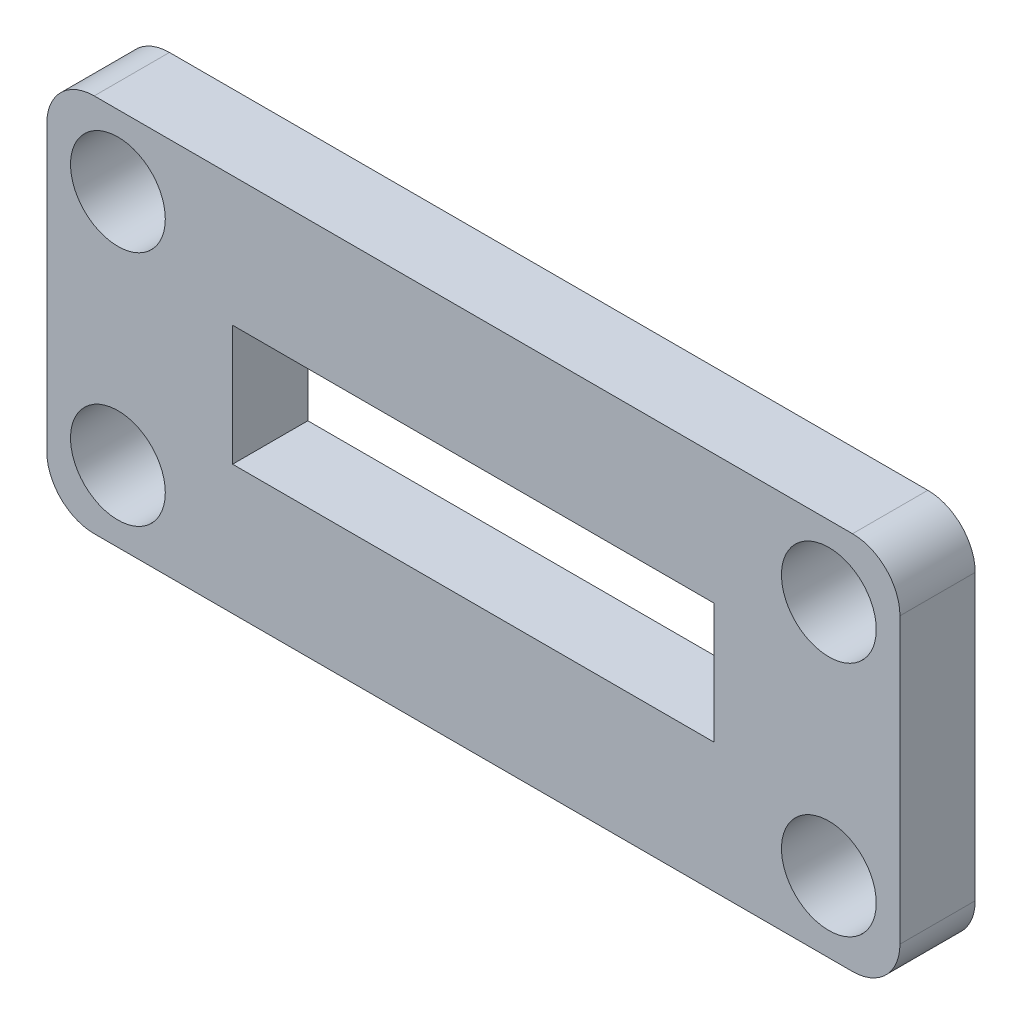
ISO-10303-21;
HEADER;
FILE_DESCRIPTION(('STEP AP214'),'2;1');
FILE_NAME('part.step','',(''),(''),'','','');
FILE_SCHEMA(('AUTOMOTIVE_DESIGN { 1 0 10303 214 1 1 1 1 }'));
ENDSEC;
DATA;
#1=APPLICATION_CONTEXT('core data for automotive mechanical design processes');
#2=APPLICATION_PROTOCOL_DEFINITION('international standard','automotive_design',2000,#1);
#3=PRODUCT_CONTEXT('',#1,'mechanical');
#4=PRODUCT('Part','Part','',(#3));
#5=PRODUCT_RELATED_PRODUCT_CATEGORY('part','',(#4));
#6=PRODUCT_DEFINITION_FORMATION('','',#4);
#7=PRODUCT_DEFINITION_CONTEXT('part definition',#1,'design');
#8=PRODUCT_DEFINITION('design','',#6,#7);
#9=PRODUCT_DEFINITION_SHAPE('','',#8);
#10=(LENGTH_UNIT() NAMED_UNIT(*) SI_UNIT(.MILLI.,.METRE.));
#11=(NAMED_UNIT(*) PLANE_ANGLE_UNIT() SI_UNIT($,.RADIAN.));
#12=(NAMED_UNIT(*) SI_UNIT($,.STERADIAN.) SOLID_ANGLE_UNIT());
#13=UNCERTAINTY_MEASURE_WITH_UNIT(LENGTH_MEASURE(1.E-05),#10,'distance_accuracy_value','');
#14=(GEOMETRIC_REPRESENTATION_CONTEXT(3) GLOBAL_UNCERTAINTY_ASSIGNED_CONTEXT((#13)) GLOBAL_UNIT_ASSIGNED_CONTEXT((#10,
#11,#12)) REPRESENTATION_CONTEXT('',''));
#15=CARTESIAN_POINT('',(0.,0.,0.));
#16=DIRECTION('',(0.,0.,1.));
#17=DIRECTION('',(1.,0.,0.));
#18=AXIS2_PLACEMENT_3D('',#15,#16,#17);
#19=CARTESIAN_POINT('',(16.,6.,3.175));
#20=DIRECTION('',(0.,0.,1.));
#21=DIRECTION('',(1.,0.,0.));
#22=AXIS2_PLACEMENT_3D('',#19,#20,#21);
#23=PLANE('',#22);
#24=CARTESIAN_POINT('',(15.,-5.,3.175));
#25=DIRECTION('',(0.,0.,1.));
#26=DIRECTION('',(1.,0.,0.));
#27=AXIS2_PLACEMENT_3D('',#24,#25,#26);
#28=CIRCLE('',#27,2.);
#29=CARTESIAN_POINT('',(17.,-5.,3.175));
#30=VERTEX_POINT('',#29);
#31=EDGE_CURVE('E320',#30,#30,#28,.T.);
#32=ORIENTED_EDGE('',*,*,#31,.F.);
#33=EDGE_LOOP('',(#32));
#34=FACE_BOUND('',#33,.T.);
#35=CARTESIAN_POINT('',(-15.,5.,3.175));
#36=DIRECTION('',(0.,0.,1.));
#37=DIRECTION('',(1.,0.,0.));
#38=AXIS2_PLACEMENT_3D('',#35,#36,#37);
#39=CIRCLE('',#38,2.);
#40=CARTESIAN_POINT('',(-13.,5.,3.175));
#41=VERTEX_POINT('',#40);
#42=EDGE_CURVE('E151',#41,#41,#39,.T.);
#43=ORIENTED_EDGE('',*,*,#42,.F.);
#44=EDGE_LOOP('',(#43));
#45=FACE_BOUND('',#44,.T.);
#46=CARTESIAN_POINT('',(16.,6.,3.175));
#47=DIRECTION('',(0.,0.,1.));
#48=DIRECTION('',(1.,0.,0.));
#49=AXIS2_PLACEMENT_3D('',#46,#47,#48);
#50=CIRCLE('',#49,2.);
#51=CARTESIAN_POINT('',(18.,6.,3.175));
#52=VERTEX_POINT('',#51);
#53=CARTESIAN_POINT('',(16.,8.,3.175));
#54=VERTEX_POINT('',#53);
#55=EDGE_CURVE('E161',#52,#54,#50,.T.);
#56=ORIENTED_EDGE('',*,*,#55,.T.);
#57=DIRECTION('',(-1.,0.,0.));
#58=VECTOR('',#57,1.);
#59=CARTESIAN_POINT('',(16.,8.,3.175));
#60=LINE('',#59,#58);
#61=CARTESIAN_POINT('',(-16.,7.99999999999999,3.175));
#62=VERTEX_POINT('',#61);
#63=EDGE_CURVE('E164',#54,#62,#60,.T.);
#64=ORIENTED_EDGE('',*,*,#63,.T.);
#65=CARTESIAN_POINT('',(-16.,6.,3.175));
#66=DIRECTION('',(0.,0.,1.));
#67=DIRECTION('',(1.,0.,0.));
#68=AXIS2_PLACEMENT_3D('',#65,#66,#67);
#69=CIRCLE('',#68,2.);
#70=CARTESIAN_POINT('',(-18.,6.,3.175));
#71=VERTEX_POINT('',#70);
#72=EDGE_CURVE('E167',#62,#71,#69,.T.);
#73=ORIENTED_EDGE('',*,*,#72,.T.);
#74=DIRECTION('',(0.,-1.,0.));
#75=VECTOR('',#74,1.);
#76=CARTESIAN_POINT('',(-18.,-6.,3.175));
#77=LINE('',#76,#75);
#78=CARTESIAN_POINT('',(-18.,-6.,3.175));
#79=VERTEX_POINT('',#78);
#80=EDGE_CURVE('E169',#71,#79,#77,.T.);
#81=ORIENTED_EDGE('',*,*,#80,.T.);
#82=CARTESIAN_POINT('',(-16.,-6.,3.175));
#83=DIRECTION('',(0.,0.,1.));
#84=DIRECTION('',(1.,0.,0.));
#85=AXIS2_PLACEMENT_3D('',#82,#83,#84);
#86=CIRCLE('',#85,2.);
#87=CARTESIAN_POINT('',(-16.,-8.,3.175));
#88=VERTEX_POINT('',#87);
#89=EDGE_CURVE('E171',#79,#88,#86,.T.);
#90=ORIENTED_EDGE('',*,*,#89,.T.);
#91=DIRECTION('',(1.,0.,0.));
#92=VECTOR('',#91,1.);
#93=CARTESIAN_POINT('',(16.,-8.,3.175));
#94=LINE('',#93,#92);
#95=CARTESIAN_POINT('',(16.,-8.,3.175));
#96=VERTEX_POINT('',#95);
#97=EDGE_CURVE('E173',#88,#96,#94,.T.);
#98=ORIENTED_EDGE('',*,*,#97,.T.);
#99=CARTESIAN_POINT('',(16.,-6.,3.175));
#100=DIRECTION('',(0.,0.,1.));
#101=DIRECTION('',(1.,0.,0.));
#102=AXIS2_PLACEMENT_3D('',#99,#100,#101);
#103=CIRCLE('',#102,2.);
#104=CARTESIAN_POINT('',(18.,-6.,3.175));
#105=VERTEX_POINT('',#104);
#106=EDGE_CURVE('E175',#96,#105,#103,.T.);
#107=ORIENTED_EDGE('',*,*,#106,.T.);
#108=DIRECTION('',(0.,1.,0.));
#109=VECTOR('',#108,1.);
#110=CARTESIAN_POINT('',(18.,-6.,3.175));
#111=LINE('',#110,#109);
#112=EDGE_CURVE('E177',#105,#52,#111,.T.);
#113=ORIENTED_EDGE('',*,*,#112,.T.);
#114=EDGE_LOOP('',(#56,#64,#73,#81,#90,#98,#107,#113));
#115=FACE_BOUND('',#114,.T.);
#116=DIRECTION('',(0.,1.,0.));
#117=VECTOR('',#116,1.);
#118=CARTESIAN_POINT('',(10.16,-2.54,3.175));
#119=LINE('',#118,#117);
#120=CARTESIAN_POINT('',(10.16,-2.54,3.175));
#121=VERTEX_POINT('',#120);
#122=CARTESIAN_POINT('',(10.16,2.53999999999999,3.175));
#123=VERTEX_POINT('',#122);
#124=EDGE_CURVE('E130',#121,#123,#119,.T.);
#125=ORIENTED_EDGE('',*,*,#124,.F.);
#126=DIRECTION('',(1.,0.,0.));
#127=VECTOR('',#126,1.);
#128=CARTESIAN_POINT('',(10.16,-2.54,3.175));
#129=LINE('',#128,#127);
#130=CARTESIAN_POINT('',(-10.16,-2.54,3.175));
#131=VERTEX_POINT('',#130);
#132=EDGE_CURVE('E122',#131,#121,#129,.T.);
#133=ORIENTED_EDGE('',*,*,#132,.F.);
#134=DIRECTION('',(0.,-1.,0.));
#135=VECTOR('',#134,1.);
#136=CARTESIAN_POINT('',(-10.16,-2.54,3.175));
#137=LINE('',#136,#135);
#138=CARTESIAN_POINT('',(-10.16,2.54,3.175));
#139=VERTEX_POINT('',#138);
#140=EDGE_CURVE('E145',#139,#131,#137,.T.);
#141=ORIENTED_EDGE('',*,*,#140,.F.);
#142=DIRECTION('',(-1.,0.,0.));
#143=VECTOR('',#142,1.);
#144=CARTESIAN_POINT('',(10.16,2.53999999999999,3.175));
#145=LINE('',#144,#143);
#146=EDGE_CURVE('E143',#123,#139,#145,.T.);
#147=ORIENTED_EDGE('',*,*,#146,.F.);
#148=EDGE_LOOP('',(#125,#133,#141,#147));
#149=FACE_BOUND('',#148,.T.);
#150=CARTESIAN_POINT('',(-15.,-5.00000000000001,3.175));
#151=DIRECTION('',(0.,0.,1.));
#152=DIRECTION('',(1.,0.,0.));
#153=AXIS2_PLACEMENT_3D('',#150,#151,#152);
#154=CIRCLE('',#153,2.);
#155=CARTESIAN_POINT('',(-13.,-5.00000000000001,3.175));
#156=VERTEX_POINT('',#155);
#157=EDGE_CURVE('E326',#156,#156,#154,.T.);
#158=ORIENTED_EDGE('',*,*,#157,.F.);
#159=EDGE_LOOP('',(#158));
#160=FACE_BOUND('',#159,.T.);
#161=CARTESIAN_POINT('',(15.,5.,3.175));
#162=DIRECTION('',(0.,0.,1.));
#163=DIRECTION('',(1.,0.,0.));
#164=AXIS2_PLACEMENT_3D('',#161,#162,#163);
#165=CIRCLE('',#164,2.);
#166=CARTESIAN_POINT('',(17.,5.,3.175));
#167=VERTEX_POINT('',#166);
#168=EDGE_CURVE('E311',#167,#167,#165,.T.);
#169=ORIENTED_EDGE('',*,*,#168,.F.);
#170=EDGE_LOOP('',(#169));
#171=FACE_BOUND('',#170,.T.);
#172=ADVANCED_FACE('F33',(#34,#45,#115,#149,#160,#171),#23,.T.);
#173=CARTESIAN_POINT('',(16.,6.,0.));
#174=DIRECTION('',(0.,0.,1.));
#175=DIRECTION('',(1.,0.,0.));
#176=AXIS2_PLACEMENT_3D('',#173,#174,#175);
#177=PLANE('',#176);
#178=CARTESIAN_POINT('',(15.,-5.,0.));
#179=DIRECTION('',(0.,0.,1.));
#180=DIRECTION('',(1.,0.,0.));
#181=AXIS2_PLACEMENT_3D('',#178,#179,#180);
#182=CIRCLE('',#181,2.);
#183=CARTESIAN_POINT('',(17.,-5.,0.));
#184=VERTEX_POINT('',#183);
#185=EDGE_CURVE('E317',#184,#184,#182,.T.);
#186=ORIENTED_EDGE('',*,*,#185,.T.);
#187=EDGE_LOOP('',(#186));
#188=FACE_BOUND('',#187,.T.);
#189=CARTESIAN_POINT('',(-15.,5.,0.));
#190=DIRECTION('',(0.,0.,1.));
#191=DIRECTION('',(1.,0.,0.));
#192=AXIS2_PLACEMENT_3D('',#189,#190,#191);
#193=CIRCLE('',#192,2.);
#194=CARTESIAN_POINT('',(-13.,5.,0.));
#195=VERTEX_POINT('',#194);
#196=EDGE_CURVE('E329',#195,#195,#193,.T.);
#197=ORIENTED_EDGE('',*,*,#196,.T.);
#198=EDGE_LOOP('',(#197));
#199=FACE_BOUND('',#198,.T.);
#200=CARTESIAN_POINT('',(16.,6.,0.));
#201=DIRECTION('',(0.,0.,1.));
#202=DIRECTION('',(1.,0.,0.));
#203=AXIS2_PLACEMENT_3D('',#200,#201,#202);
#204=CIRCLE('',#203,2.);
#205=CARTESIAN_POINT('',(18.,6.,0.));
#206=VERTEX_POINT('',#205);
#207=CARTESIAN_POINT('',(16.,8.,0.));
#208=VERTEX_POINT('',#207);
#209=EDGE_CURVE('E138',#206,#208,#204,.T.);
#210=ORIENTED_EDGE('',*,*,#209,.F.);
#211=DIRECTION('',(0.,1.,0.));
#212=VECTOR('',#211,1.);
#213=CARTESIAN_POINT('',(18.,-6.,0.));
#214=LINE('',#213,#212);
#215=CARTESIAN_POINT('',(18.,-6.,0.));
#216=VERTEX_POINT('',#215);
#217=EDGE_CURVE('E165',#216,#206,#214,.T.);
#218=ORIENTED_EDGE('',*,*,#217,.F.);
#219=CARTESIAN_POINT('',(16.,-6.,0.));
#220=DIRECTION('',(0.,0.,1.));
#221=DIRECTION('',(1.,0.,0.));
#222=AXIS2_PLACEMENT_3D('',#219,#220,#221);
#223=CIRCLE('',#222,2.);
#224=CARTESIAN_POINT('',(16.,-8.,0.));
#225=VERTEX_POINT('',#224);
#226=EDGE_CURVE('E192',#225,#216,#223,.T.);
#227=ORIENTED_EDGE('',*,*,#226,.F.);
#228=DIRECTION('',(1.,0.,0.));
#229=VECTOR('',#228,1.);
#230=CARTESIAN_POINT('',(16.,-8.,0.));
#231=LINE('',#230,#229);
#232=CARTESIAN_POINT('',(-16.,-8.,0.));
#233=VERTEX_POINT('',#232);
#234=EDGE_CURVE('E190',#233,#225,#231,.T.);
#235=ORIENTED_EDGE('',*,*,#234,.F.);
#236=CARTESIAN_POINT('',(-16.,-6.,0.));
#237=DIRECTION('',(0.,0.,1.));
#238=DIRECTION('',(1.,0.,0.));
#239=AXIS2_PLACEMENT_3D('',#236,#237,#238);
#240=CIRCLE('',#239,2.);
#241=CARTESIAN_POINT('',(-18.,-6.,0.));
#242=VERTEX_POINT('',#241);
#243=EDGE_CURVE('E188',#242,#233,#240,.T.);
#244=ORIENTED_EDGE('',*,*,#243,.F.);
#245=DIRECTION('',(0.,-1.,0.));
#246=VECTOR('',#245,1.);
#247=CARTESIAN_POINT('',(-18.,-6.,0.));
#248=LINE('',#247,#246);
#249=CARTESIAN_POINT('',(-18.,6.,0.));
#250=VERTEX_POINT('',#249);
#251=EDGE_CURVE('E186',#250,#242,#248,.T.);
#252=ORIENTED_EDGE('',*,*,#251,.F.);
#253=CARTESIAN_POINT('',(-16.,6.,0.));
#254=DIRECTION('',(0.,0.,1.));
#255=DIRECTION('',(1.,0.,0.));
#256=AXIS2_PLACEMENT_3D('',#253,#254,#255);
#257=CIRCLE('',#256,2.);
#258=CARTESIAN_POINT('',(-16.,7.99999999999999,0.));
#259=VERTEX_POINT('',#258);
#260=EDGE_CURVE('E184',#259,#250,#257,.T.);
#261=ORIENTED_EDGE('',*,*,#260,.F.);
#262=DIRECTION('',(-1.,0.,0.));
#263=VECTOR('',#262,1.);
#264=CARTESIAN_POINT('',(16.,8.,0.));
#265=LINE('',#264,#263);
#266=EDGE_CURVE('E182',#208,#259,#265,.T.);
#267=ORIENTED_EDGE('',*,*,#266,.F.);
#268=EDGE_LOOP('',(#210,#218,#227,#235,#244,#252,#261,#267));
#269=FACE_BOUND('',#268,.T.);
#270=DIRECTION('',(1.,0.,0.));
#271=VECTOR('',#270,1.);
#272=CARTESIAN_POINT('',(10.16,-2.54,0.));
#273=LINE('',#272,#271);
#274=CARTESIAN_POINT('',(-10.16,-2.54,0.));
#275=VERTEX_POINT('',#274);
#276=CARTESIAN_POINT('',(10.16,-2.54,0.));
#277=VERTEX_POINT('',#276);
#278=EDGE_CURVE('E56',#275,#277,#273,.T.);
#279=ORIENTED_EDGE('',*,*,#278,.T.);
#280=DIRECTION('',(0.,1.,0.));
#281=VECTOR('',#280,1.);
#282=CARTESIAN_POINT('',(10.16,-2.54,0.));
#283=LINE('',#282,#281);
#284=CARTESIAN_POINT('',(10.16,2.53999999999999,0.));
#285=VERTEX_POINT('',#284);
#286=EDGE_CURVE('E137',#277,#285,#283,.T.);
#287=ORIENTED_EDGE('',*,*,#286,.T.);
#288=DIRECTION('',(-1.,0.,0.));
#289=VECTOR('',#288,1.);
#290=CARTESIAN_POINT('',(10.16,2.53999999999999,0.));
#291=LINE('',#290,#289);
#292=CARTESIAN_POINT('',(-10.16,2.54,0.));
#293=VERTEX_POINT('',#292);
#294=EDGE_CURVE('E153',#285,#293,#291,.T.);
#295=ORIENTED_EDGE('',*,*,#294,.T.);
#296=DIRECTION('',(0.,-1.,0.));
#297=VECTOR('',#296,1.);
#298=CARTESIAN_POINT('',(-10.16,-2.54,0.));
#299=LINE('',#298,#297);
#300=EDGE_CURVE('E131',#293,#275,#299,.T.);
#301=ORIENTED_EDGE('',*,*,#300,.T.);
#302=EDGE_LOOP('',(#279,#287,#295,#301));
#303=FACE_BOUND('',#302,.T.);
#304=CARTESIAN_POINT('',(-15.,-5.00000000000001,0.));
#305=DIRECTION('',(0.,0.,1.));
#306=DIRECTION('',(1.,0.,0.));
#307=AXIS2_PLACEMENT_3D('',#304,#305,#306);
#308=CIRCLE('',#307,2.);
#309=CARTESIAN_POINT('',(-13.,-5.00000000000001,0.));
#310=VERTEX_POINT('',#309);
#311=EDGE_CURVE('E323',#310,#310,#308,.T.);
#312=ORIENTED_EDGE('',*,*,#311,.T.);
#313=EDGE_LOOP('',(#312));
#314=FACE_BOUND('',#313,.T.);
#315=CARTESIAN_POINT('',(15.,5.,0.));
#316=DIRECTION('',(0.,0.,1.));
#317=DIRECTION('',(1.,0.,0.));
#318=AXIS2_PLACEMENT_3D('',#315,#316,#317);
#319=CIRCLE('',#318,2.);
#320=CARTESIAN_POINT('',(17.,5.,0.));
#321=VERTEX_POINT('',#320);
#322=EDGE_CURVE('E314',#321,#321,#319,.T.);
#323=ORIENTED_EDGE('',*,*,#322,.T.);
#324=EDGE_LOOP('',(#323));
#325=FACE_BOUND('',#324,.T.);
#326=ADVANCED_FACE('F222',(#188,#199,#269,#303,#314,#325),#177,.F.);
#327=CARTESIAN_POINT('',(16.,6.,3.175));
#328=DIRECTION('',(0.,0.,-1.));
#329=DIRECTION('',(-1.,0.,0.));
#330=AXIS2_PLACEMENT_3D('',#327,#328,#329);
#331=CYLINDRICAL_SURFACE('',#330,2.);
#332=ORIENTED_EDGE('',*,*,#209,.T.);
#333=DIRECTION('',(0.,0.,-1.));
#334=VECTOR('',#333,1.);
#335=CARTESIAN_POINT('',(16.,8.,3.175));
#336=LINE('',#335,#334);
#337=EDGE_CURVE('E11',#54,#208,#336,.T.);
#338=ORIENTED_EDGE('',*,*,#337,.F.);
#339=ORIENTED_EDGE('',*,*,#55,.F.);
#340=DIRECTION('',(0.,0.,-1.));
#341=VECTOR('',#340,1.);
#342=CARTESIAN_POINT('',(18.,6.,3.175));
#343=LINE('',#342,#341);
#344=EDGE_CURVE('E179',#52,#206,#343,.T.);
#345=ORIENTED_EDGE('',*,*,#344,.T.);
#346=EDGE_LOOP('',(#332,#338,#339,#345));
#347=FACE_BOUND('',#346,.T.);
#348=ADVANCED_FACE('F35',(#347),#331,.T.);
#349=CARTESIAN_POINT('',(16.,8.,3.175));
#350=DIRECTION('',(0.,-1.,0.));
#351=DIRECTION('',(1.,0.,0.));
#352=AXIS2_PLACEMENT_3D('',#349,#350,#351);
#353=PLANE('',#352);
#354=ORIENTED_EDGE('',*,*,#266,.T.);
#355=DIRECTION('',(0.,0.,-1.));
#356=VECTOR('',#355,1.);
#357=CARTESIAN_POINT('',(-16.,7.99999999999999,3.175));
#358=LINE('',#357,#356);
#359=EDGE_CURVE('E41',#62,#259,#358,.T.);
#360=ORIENTED_EDGE('',*,*,#359,.F.);
#361=ORIENTED_EDGE('',*,*,#63,.F.);
#362=ORIENTED_EDGE('',*,*,#337,.T.);
#363=EDGE_LOOP('',(#354,#360,#361,#362));
#364=FACE_BOUND('',#363,.T.);
#365=ADVANCED_FACE('F239',(#364),#353,.F.);
#366=CARTESIAN_POINT('',(-16.,6.,3.175));
#367=DIRECTION('',(0.,0.,-1.));
#368=DIRECTION('',(-1.,0.,0.));
#369=AXIS2_PLACEMENT_3D('',#366,#367,#368);
#370=CYLINDRICAL_SURFACE('',#369,2.);
#371=ORIENTED_EDGE('',*,*,#260,.T.);
#372=DIRECTION('',(0.,0.,-1.));
#373=VECTOR('',#372,1.);
#374=CARTESIAN_POINT('',(-18.,6.,3.175));
#375=LINE('',#374,#373);
#376=EDGE_CURVE('E209',#71,#250,#375,.T.);
#377=ORIENTED_EDGE('',*,*,#376,.F.);
#378=ORIENTED_EDGE('',*,*,#72,.F.);
#379=ORIENTED_EDGE('',*,*,#359,.T.);
#380=EDGE_LOOP('',(#371,#377,#378,#379));
#381=FACE_BOUND('',#380,.T.);
#382=ADVANCED_FACE('F216',(#381),#370,.T.);
#383=CARTESIAN_POINT('',(-18.,-6.,3.175));
#384=DIRECTION('',(1.,0.,0.));
#385=DIRECTION('',(0.,0.,-1.));
#386=AXIS2_PLACEMENT_3D('',#383,#384,#385);
#387=PLANE('',#386);
#388=ORIENTED_EDGE('',*,*,#251,.T.);
#389=DIRECTION('',(0.,0.,-1.));
#390=VECTOR('',#389,1.);
#391=CARTESIAN_POINT('',(-18.,-6.,3.175));
#392=LINE('',#391,#390);
#393=EDGE_CURVE('E206',#79,#242,#392,.T.);
#394=ORIENTED_EDGE('',*,*,#393,.F.);
#395=ORIENTED_EDGE('',*,*,#80,.F.);
#396=ORIENTED_EDGE('',*,*,#376,.T.);
#397=EDGE_LOOP('',(#388,#394,#395,#396));
#398=FACE_BOUND('',#397,.T.);
#399=ADVANCED_FACE('F228',(#398),#387,.F.);
#400=CARTESIAN_POINT('',(-16.,-6.,3.175));
#401=DIRECTION('',(0.,0.,-1.));
#402=DIRECTION('',(-1.,0.,0.));
#403=AXIS2_PLACEMENT_3D('',#400,#401,#402);
#404=CYLINDRICAL_SURFACE('',#403,2.);
#405=ORIENTED_EDGE('',*,*,#243,.T.);
#406=DIRECTION('',(0.,0.,-1.));
#407=VECTOR('',#406,1.);
#408=CARTESIAN_POINT('',(-16.,-8.,3.175));
#409=LINE('',#408,#407);
#410=EDGE_CURVE('E203',#88,#233,#409,.T.);
#411=ORIENTED_EDGE('',*,*,#410,.F.);
#412=ORIENTED_EDGE('',*,*,#89,.F.);
#413=ORIENTED_EDGE('',*,*,#393,.T.);
#414=EDGE_LOOP('',(#405,#411,#412,#413));
#415=FACE_BOUND('',#414,.T.);
#416=ADVANCED_FACE('F232',(#415),#404,.T.);
#417=CARTESIAN_POINT('',(16.,-8.,3.175));
#418=DIRECTION('',(0.,1.,0.));
#419=DIRECTION('',(0.,0.,1.));
#420=AXIS2_PLACEMENT_3D('',#417,#418,#419);
#421=PLANE('',#420);
#422=ORIENTED_EDGE('',*,*,#234,.T.);
#423=DIRECTION('',(0.,0.,-1.));
#424=VECTOR('',#423,1.);
#425=CARTESIAN_POINT('',(16.,-8.,3.175));
#426=LINE('',#425,#424);
#427=EDGE_CURVE('E200',#96,#225,#426,.T.);
#428=ORIENTED_EDGE('',*,*,#427,.F.);
#429=ORIENTED_EDGE('',*,*,#97,.F.);
#430=ORIENTED_EDGE('',*,*,#410,.T.);
#431=EDGE_LOOP('',(#422,#428,#429,#430));
#432=FACE_BOUND('',#431,.T.);
#433=ADVANCED_FACE('F252',(#432),#421,.F.);
#434=CARTESIAN_POINT('',(16.,-6.,3.175));
#435=DIRECTION('',(0.,0.,-1.));
#436=DIRECTION('',(-1.,0.,0.));
#437=AXIS2_PLACEMENT_3D('',#434,#435,#436);
#438=CYLINDRICAL_SURFACE('',#437,2.);
#439=ORIENTED_EDGE('',*,*,#226,.T.);
#440=DIRECTION('',(0.,0.,-1.));
#441=VECTOR('',#440,1.);
#442=CARTESIAN_POINT('',(18.,-6.,3.175));
#443=LINE('',#442,#441);
#444=EDGE_CURVE('E197',#105,#216,#443,.T.);
#445=ORIENTED_EDGE('',*,*,#444,.F.);
#446=ORIENTED_EDGE('',*,*,#106,.F.);
#447=ORIENTED_EDGE('',*,*,#427,.T.);
#448=EDGE_LOOP('',(#439,#445,#446,#447));
#449=FACE_BOUND('',#448,.T.);
#450=ADVANCED_FACE('F250',(#449),#438,.T.);
#451=CARTESIAN_POINT('',(18.,-6.,3.175));
#452=DIRECTION('',(-1.,0.,0.));
#453=DIRECTION('',(0.,0.,1.));
#454=AXIS2_PLACEMENT_3D('',#451,#452,#453);
#455=PLANE('',#454);
#456=ORIENTED_EDGE('',*,*,#217,.T.);
#457=ORIENTED_EDGE('',*,*,#344,.F.);
#458=ORIENTED_EDGE('',*,*,#112,.F.);
#459=ORIENTED_EDGE('',*,*,#444,.T.);
#460=EDGE_LOOP('',(#456,#457,#458,#459));
#461=FACE_BOUND('',#460,.T.);
#462=ADVANCED_FACE('F245',(#461),#455,.F.);
#463=CARTESIAN_POINT('',(10.16,-2.54,3.175));
#464=DIRECTION('',(0.,1.,0.));
#465=DIRECTION('',(-1.,0.,0.));
#466=AXIS2_PLACEMENT_3D('',#463,#464,#465);
#467=PLANE('',#466);
#468=ORIENTED_EDGE('',*,*,#278,.F.);
#469=DIRECTION('',(0.,0.,-1.));
#470=VECTOR('',#469,1.);
#471=CARTESIAN_POINT('',(-10.16,-2.54,3.175));
#472=LINE('',#471,#470);
#473=EDGE_CURVE('E126',#131,#275,#472,.T.);
#474=ORIENTED_EDGE('',*,*,#473,.F.);
#475=ORIENTED_EDGE('',*,*,#132,.T.);
#476=DIRECTION('',(0.,0.,-1.));
#477=VECTOR('',#476,1.);
#478=CARTESIAN_POINT('',(10.16,-2.54,3.175));
#479=LINE('',#478,#477);
#480=EDGE_CURVE('E125',#121,#277,#479,.T.);
#481=ORIENTED_EDGE('',*,*,#480,.T.);
#482=EDGE_LOOP('',(#468,#474,#475,#481));
#483=FACE_BOUND('',#482,.T.);
#484=ADVANCED_FACE('F124',(#483),#467,.T.);
#485=CARTESIAN_POINT('',(10.16,-2.54,3.175));
#486=DIRECTION('',(-1.,0.,0.));
#487=DIRECTION('',(0.,0.,1.));
#488=AXIS2_PLACEMENT_3D('',#485,#486,#487);
#489=PLANE('',#488);
#490=ORIENTED_EDGE('',*,*,#286,.F.);
#491=ORIENTED_EDGE('',*,*,#480,.F.);
#492=ORIENTED_EDGE('',*,*,#124,.T.);
#493=DIRECTION('',(0.,0.,-1.));
#494=VECTOR('',#493,1.);
#495=CARTESIAN_POINT('',(10.16,2.53999999999999,3.175));
#496=LINE('',#495,#494);
#497=EDGE_CURVE('E139',#123,#285,#496,.T.);
#498=ORIENTED_EDGE('',*,*,#497,.T.);
#499=EDGE_LOOP('',(#490,#491,#492,#498));
#500=FACE_BOUND('',#499,.T.);
#501=ADVANCED_FACE('F134',(#500),#489,.T.);
#502=CARTESIAN_POINT('',(10.16,2.53999999999999,3.175));
#503=DIRECTION('',(0.,-1.,0.));
#504=DIRECTION('',(1.,0.,0.));
#505=AXIS2_PLACEMENT_3D('',#502,#503,#504);
#506=PLANE('',#505);
#507=ORIENTED_EDGE('',*,*,#294,.F.);
#508=ORIENTED_EDGE('',*,*,#497,.F.);
#509=ORIENTED_EDGE('',*,*,#146,.T.);
#510=DIRECTION('',(0.,0.,-1.));
#511=VECTOR('',#510,1.);
#512=CARTESIAN_POINT('',(-10.16,2.54,3.175));
#513=LINE('',#512,#511);
#514=EDGE_CURVE('E48',#139,#293,#513,.T.);
#515=ORIENTED_EDGE('',*,*,#514,.T.);
#516=EDGE_LOOP('',(#507,#508,#509,#515));
#517=FACE_BOUND('',#516,.T.);
#518=ADVANCED_FACE('F281',(#517),#506,.T.);
#519=CARTESIAN_POINT('',(-10.16,-2.54,3.175));
#520=DIRECTION('',(1.,0.,0.));
#521=DIRECTION('',(0.,0.,-1.));
#522=AXIS2_PLACEMENT_3D('',#519,#520,#521);
#523=PLANE('',#522);
#524=ORIENTED_EDGE('',*,*,#300,.F.);
#525=ORIENTED_EDGE('',*,*,#514,.F.);
#526=ORIENTED_EDGE('',*,*,#140,.T.);
#527=ORIENTED_EDGE('',*,*,#473,.T.);
#528=EDGE_LOOP('',(#524,#525,#526,#527));
#529=FACE_BOUND('',#528,.T.);
#530=ADVANCED_FACE('F285',(#529),#523,.T.);
#531=CARTESIAN_POINT('',(-15.,5.,3.175));
#532=DIRECTION('',(0.,0.,-1.));
#533=DIRECTION('',(-1.,0.,0.));
#534=AXIS2_PLACEMENT_3D('',#531,#532,#533);
#535=CYLINDRICAL_SURFACE('',#534,2.);
#536=ORIENTED_EDGE('',*,*,#42,.T.);
#537=EDGE_LOOP('',(#536));
#538=FACE_BOUND('',#537,.T.);
#539=ORIENTED_EDGE('',*,*,#196,.F.);
#540=EDGE_LOOP('',(#539));
#541=FACE_BOUND('',#540,.T.);
#542=ADVANCED_FACE('F291',(#538,#541),#535,.F.);
#543=CARTESIAN_POINT('',(-15.,-5.00000000000001,3.175));
#544=DIRECTION('',(0.,0.,-1.));
#545=DIRECTION('',(-1.,0.,0.));
#546=AXIS2_PLACEMENT_3D('',#543,#544,#545);
#547=CYLINDRICAL_SURFACE('',#546,2.);
#548=ORIENTED_EDGE('',*,*,#157,.T.);
#549=EDGE_LOOP('',(#548));
#550=FACE_BOUND('',#549,.T.);
#551=ORIENTED_EDGE('',*,*,#311,.F.);
#552=EDGE_LOOP('',(#551));
#553=FACE_BOUND('',#552,.T.);
#554=ADVANCED_FACE('F294',(#550,#553),#547,.F.);
#555=CARTESIAN_POINT('',(15.,-5.,3.175));
#556=DIRECTION('',(0.,0.,-1.));
#557=DIRECTION('',(-1.,0.,0.));
#558=AXIS2_PLACEMENT_3D('',#555,#556,#557);
#559=CYLINDRICAL_SURFACE('',#558,2.);
#560=ORIENTED_EDGE('',*,*,#31,.T.);
#561=EDGE_LOOP('',(#560));
#562=FACE_BOUND('',#561,.T.);
#563=ORIENTED_EDGE('',*,*,#185,.F.);
#564=EDGE_LOOP('',(#563));
#565=FACE_BOUND('',#564,.T.);
#566=ADVANCED_FACE('F298',(#562,#565),#559,.F.);
#567=CARTESIAN_POINT('',(15.,5.,3.175));
#568=DIRECTION('',(0.,0.,-1.));
#569=DIRECTION('',(-1.,0.,0.));
#570=AXIS2_PLACEMENT_3D('',#567,#568,#569);
#571=CYLINDRICAL_SURFACE('',#570,2.);
#572=ORIENTED_EDGE('',*,*,#168,.T.);
#573=EDGE_LOOP('',(#572));
#574=FACE_BOUND('',#573,.T.);
#575=ORIENTED_EDGE('',*,*,#322,.F.);
#576=EDGE_LOOP('',(#575));
#577=FACE_BOUND('',#576,.T.);
#578=ADVANCED_FACE('F302',(#574,#577),#571,.F.);
#579=CLOSED_SHELL('',(#172,#326,#348,#365,#382,#399,#416,#433,#450,#462,#484,#501,#518,#530,
#542,#554,#566,#578));
#580=MANIFOLD_SOLID_BREP('B2',#579);
#581=ADVANCED_BREP_SHAPE_REPRESENTATION('',(#18,#580),#14);
#582=SHAPE_DEFINITION_REPRESENTATION(#9,#581);
ENDSEC;
END-ISO-10303-21;
